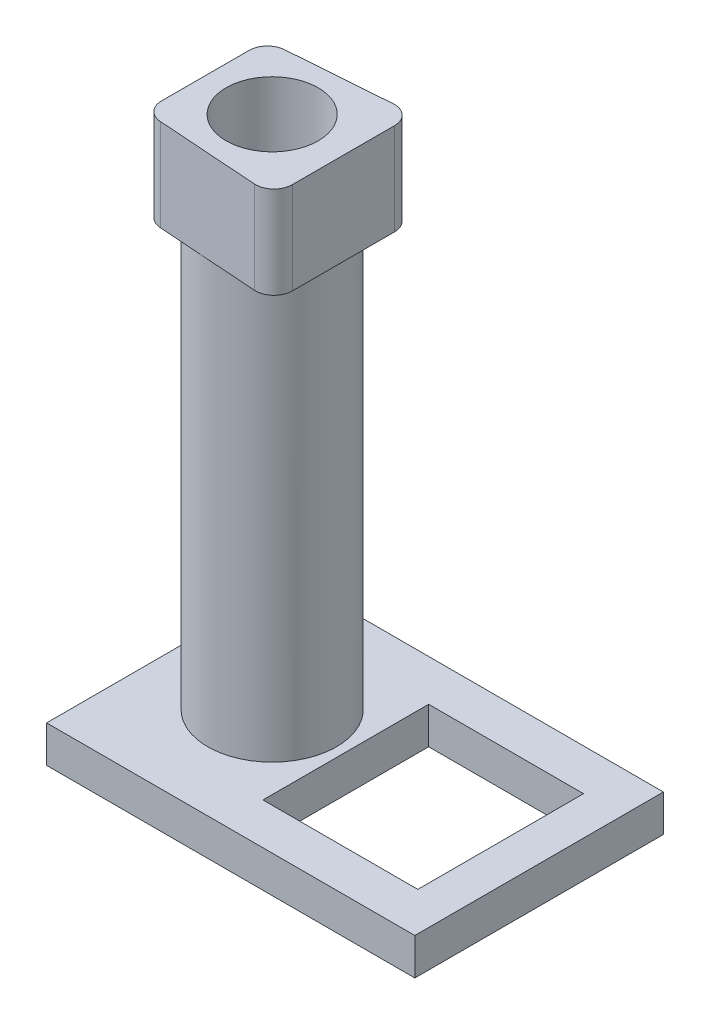
ISO-10303-21;
HEADER;
FILE_DESCRIPTION(('STEP AP214'),'2;1');
FILE_NAME('part.step','',(''),(''),'','','');
FILE_SCHEMA(('AUTOMOTIVE_DESIGN { 1 0 10303 214 1 1 1 1 }'));
ENDSEC;
DATA;
#1=APPLICATION_CONTEXT('core data for automotive mechanical design processes');
#2=APPLICATION_PROTOCOL_DEFINITION('international standard','automotive_design',2000,#1);
#3=PRODUCT_CONTEXT('',#1,'mechanical');
#4=PRODUCT('Part','Part','',(#3));
#5=PRODUCT_RELATED_PRODUCT_CATEGORY('part','',(#4));
#6=PRODUCT_DEFINITION_FORMATION('','',#4);
#7=PRODUCT_DEFINITION_CONTEXT('part definition',#1,'design');
#8=PRODUCT_DEFINITION('design','',#6,#7);
#9=PRODUCT_DEFINITION_SHAPE('','',#8);
#10=(LENGTH_UNIT() NAMED_UNIT(*) SI_UNIT(.MILLI.,.METRE.));
#11=(NAMED_UNIT(*) PLANE_ANGLE_UNIT() SI_UNIT($,.RADIAN.));
#12=(NAMED_UNIT(*) SI_UNIT($,.STERADIAN.) SOLID_ANGLE_UNIT());
#13=UNCERTAINTY_MEASURE_WITH_UNIT(LENGTH_MEASURE(1.E-05),#10,'distance_accuracy_value','');
#14=(GEOMETRIC_REPRESENTATION_CONTEXT(3) GLOBAL_UNCERTAINTY_ASSIGNED_CONTEXT((#13)) GLOBAL_UNIT_ASSIGNED_CONTEXT((#10,
#11,#12)) REPRESENTATION_CONTEXT('',''));
#15=CARTESIAN_POINT('',(0.,0.,0.));
#16=DIRECTION('',(0.,0.,1.));
#17=DIRECTION('',(1.,0.,0.));
#18=AXIS2_PLACEMENT_3D('',#15,#16,#17);
#19=CARTESIAN_POINT('',(0.,20.,0.));
#20=DIRECTION('',(0.,-1.,0.));
#21=DIRECTION('',(0.,0.,-1.));
#22=AXIS2_PLACEMENT_3D('',#19,#20,#21);
#23=PLANE('',#22);
#24=CARTESIAN_POINT('',(0.,20.,0.));
#25=DIRECTION('',(0.,-1.,0.));
#26=DIRECTION('',(0.,0.,-1.));
#27=AXIS2_PLACEMENT_3D('',#24,#25,#26);
#28=CIRCLE('',#27,35.);
#29=CARTESIAN_POINT('',(0.,20.,-35.));
#30=VERTEX_POINT('',#29);
#31=EDGE_CURVE('E12',#30,#30,#28,.F.);
#32=ORIENTED_EDGE('',*,*,#31,.F.);
#33=EDGE_LOOP('',(#32));
#34=FACE_BOUND('',#33,.T.);
#35=DIRECTION('',(0.,0.,-1.));
#36=VECTOR('',#35,1.);
#37=CARTESIAN_POINT('',(145.,20.,67.5));
#38=LINE('',#37,#36);
#39=CARTESIAN_POINT('',(145.,20.,67.5));
#40=VERTEX_POINT('',#39);
#41=CARTESIAN_POINT('',(145.,20.,-67.5));
#42=VERTEX_POINT('',#41);
#43=EDGE_CURVE('E218',#40,#42,#38,.T.);
#44=ORIENTED_EDGE('',*,*,#43,.T.);
#45=DIRECTION('',(-1.,0.,0.));
#46=VECTOR('',#45,1.);
#47=CARTESIAN_POINT('',(-55.,20.,-67.5));
#48=LINE('',#47,#46);
#49=CARTESIAN_POINT('',(-55.,20.,-67.5));
#50=VERTEX_POINT('',#49);
#51=EDGE_CURVE('E221',#42,#50,#48,.T.);
#52=ORIENTED_EDGE('',*,*,#51,.T.);
#53=DIRECTION('',(0.,0.,1.));
#54=VECTOR('',#53,1.);
#55=CARTESIAN_POINT('',(-55.,20.,67.5));
#56=LINE('',#55,#54);
#57=CARTESIAN_POINT('',(-55.,20.,67.5));
#58=VERTEX_POINT('',#57);
#59=EDGE_CURVE('E224',#50,#58,#56,.T.);
#60=ORIENTED_EDGE('',*,*,#59,.T.);
#61=DIRECTION('',(1.,0.,0.));
#62=VECTOR('',#61,1.);
#63=CARTESIAN_POINT('',(-55.,20.,67.5));
#64=LINE('',#63,#62);
#65=EDGE_CURVE('E226',#58,#40,#64,.T.);
#66=ORIENTED_EDGE('',*,*,#65,.T.);
#67=EDGE_LOOP('',(#44,#52,#60,#66));
#68=FACE_BOUND('',#67,.T.);
#69=DIRECTION('',(0.,0.,1.));
#70=VECTOR('',#69,1.);
#71=CARTESIAN_POINT('',(40.,20.,45.));
#72=LINE('',#71,#70);
#73=CARTESIAN_POINT('',(40.,20.,-45.));
#74=VERTEX_POINT('',#73);
#75=CARTESIAN_POINT('',(40.,20.,45.));
#76=VERTEX_POINT('',#75);
#77=EDGE_CURVE('E192',#74,#76,#72,.T.);
#78=ORIENTED_EDGE('',*,*,#77,.F.);
#79=DIRECTION('',(-1.,0.,0.));
#80=VECTOR('',#79,1.);
#81=CARTESIAN_POINT('',(40.,20.,-45.));
#82=LINE('',#81,#80);
#83=CARTESIAN_POINT('',(124.112104211628,20.,-45.));
#84=VERTEX_POINT('',#83);
#85=EDGE_CURVE('E199',#84,#74,#82,.T.);
#86=ORIENTED_EDGE('',*,*,#85,.F.);
#87=DIRECTION('',(0.,0.,-1.));
#88=VECTOR('',#87,1.);
#89=CARTESIAN_POINT('',(124.112104211628,20.,45.));
#90=LINE('',#89,#88);
#91=CARTESIAN_POINT('',(124.112104211628,20.,45.));
#92=VERTEX_POINT('',#91);
#93=EDGE_CURVE('E197',#92,#84,#90,.T.);
#94=ORIENTED_EDGE('',*,*,#93,.F.);
#95=DIRECTION('',(1.,0.,0.));
#96=VECTOR('',#95,1.);
#97=CARTESIAN_POINT('',(40.,20.,45.));
#98=LINE('',#97,#96);
#99=EDGE_CURVE('E194',#76,#92,#98,.T.);
#100=ORIENTED_EDGE('',*,*,#99,.F.);
#101=EDGE_LOOP('',(#78,#86,#94,#100));
#102=FACE_BOUND('',#101,.T.);
#103=ADVANCED_FACE('F40',(#34,#68,#102),#23,.F.);
#104=CARTESIAN_POINT('',(0.,0.,0.));
#105=DIRECTION('',(0.,-1.,0.));
#106=DIRECTION('',(0.,0.,-1.));
#107=AXIS2_PLACEMENT_3D('',#104,#105,#106);
#108=PLANE('',#107);
#109=DIRECTION('',(0.,0.,-1.));
#110=VECTOR('',#109,1.);
#111=CARTESIAN_POINT('',(145.,0.,67.5));
#112=LINE('',#111,#110);
#113=CARTESIAN_POINT('',(145.,0.,67.5));
#114=VERTEX_POINT('',#113);
#115=CARTESIAN_POINT('',(145.,0.,-67.5));
#116=VERTEX_POINT('',#115);
#117=EDGE_CURVE('E217',#114,#116,#112,.T.);
#118=ORIENTED_EDGE('',*,*,#117,.F.);
#119=DIRECTION('',(1.,0.,0.));
#120=VECTOR('',#119,1.);
#121=CARTESIAN_POINT('',(-55.,0.,67.5));
#122=LINE('',#121,#120);
#123=CARTESIAN_POINT('',(-55.,0.,67.5));
#124=VERTEX_POINT('',#123);
#125=EDGE_CURVE('E222',#124,#114,#122,.T.);
#126=ORIENTED_EDGE('',*,*,#125,.F.);
#127=DIRECTION('',(0.,0.,1.));
#128=VECTOR('',#127,1.);
#129=CARTESIAN_POINT('',(-55.,0.,67.5));
#130=LINE('',#129,#128);
#131=CARTESIAN_POINT('',(-55.,0.,-67.5));
#132=VERTEX_POINT('',#131);
#133=EDGE_CURVE('E233',#132,#124,#130,.T.);
#134=ORIENTED_EDGE('',*,*,#133,.F.);
#135=DIRECTION('',(-1.,0.,0.));
#136=VECTOR('',#135,1.);
#137=CARTESIAN_POINT('',(-55.,0.,-67.5));
#138=LINE('',#137,#136);
#139=EDGE_CURVE('E231',#116,#132,#138,.T.);
#140=ORIENTED_EDGE('',*,*,#139,.F.);
#141=EDGE_LOOP('',(#118,#126,#134,#140));
#142=FACE_BOUND('',#141,.T.);
#143=DIRECTION('',(-1.,0.,0.));
#144=VECTOR('',#143,1.);
#145=CARTESIAN_POINT('',(40.,0.,-45.));
#146=LINE('',#145,#144);
#147=CARTESIAN_POINT('',(124.112104211628,0.,-45.));
#148=VERTEX_POINT('',#147);
#149=CARTESIAN_POINT('',(40.,0.,-45.));
#150=VERTEX_POINT('',#149);
#151=EDGE_CURVE('E195',#148,#150,#146,.T.);
#152=ORIENTED_EDGE('',*,*,#151,.T.);
#153=DIRECTION('',(0.,0.,1.));
#154=VECTOR('',#153,1.);
#155=CARTESIAN_POINT('',(40.,0.,45.));
#156=LINE('',#155,#154);
#157=CARTESIAN_POINT('',(40.,0.,45.));
#158=VERTEX_POINT('',#157);
#159=EDGE_CURVE('E63',#150,#158,#156,.T.);
#160=ORIENTED_EDGE('',*,*,#159,.T.);
#161=DIRECTION('',(1.,0.,0.));
#162=VECTOR('',#161,1.);
#163=CARTESIAN_POINT('',(40.,0.,45.));
#164=LINE('',#163,#162);
#165=CARTESIAN_POINT('',(124.112104211628,0.,45.));
#166=VERTEX_POINT('',#165);
#167=EDGE_CURVE('E203',#158,#166,#164,.T.);
#168=ORIENTED_EDGE('',*,*,#167,.T.);
#169=DIRECTION('',(0.,0.,-1.));
#170=VECTOR('',#169,1.);
#171=CARTESIAN_POINT('',(124.112104211628,0.,45.));
#172=LINE('',#171,#170);
#173=EDGE_CURVE('E206',#166,#148,#172,.T.);
#174=ORIENTED_EDGE('',*,*,#173,.T.);
#175=EDGE_LOOP('',(#152,#160,#168,#174));
#176=FACE_BOUND('',#175,.T.);
#177=ADVANCED_FACE('F254',(#142,#176),#108,.T.);
#178=CARTESIAN_POINT('',(145.,20.,67.5));
#179=DIRECTION('',(-1.,0.,0.));
#180=DIRECTION('',(0.,0.,1.));
#181=AXIS2_PLACEMENT_3D('',#178,#179,#180);
#182=PLANE('',#181);
#183=ORIENTED_EDGE('',*,*,#117,.T.);
#184=DIRECTION('',(0.,-1.,0.));
#185=VECTOR('',#184,1.);
#186=CARTESIAN_POINT('',(145.,20.,-67.5));
#187=LINE('',#186,#185);
#188=EDGE_CURVE('E48',#42,#116,#187,.T.);
#189=ORIENTED_EDGE('',*,*,#188,.F.);
#190=ORIENTED_EDGE('',*,*,#43,.F.);
#191=DIRECTION('',(0.,-1.,0.));
#192=VECTOR('',#191,1.);
#193=CARTESIAN_POINT('',(145.,20.,67.5));
#194=LINE('',#193,#192);
#195=EDGE_CURVE('E228',#40,#114,#194,.T.);
#196=ORIENTED_EDGE('',*,*,#195,.T.);
#197=EDGE_LOOP('',(#183,#189,#190,#196));
#198=FACE_BOUND('',#197,.T.);
#199=ADVANCED_FACE('F42',(#198),#182,.F.);
#200=CARTESIAN_POINT('',(-55.,20.,-67.5));
#201=DIRECTION('',(0.,0.,1.));
#202=DIRECTION('',(1.,0.,0.));
#203=AXIS2_PLACEMENT_3D('',#200,#201,#202);
#204=PLANE('',#203);
#205=ORIENTED_EDGE('',*,*,#139,.T.);
#206=DIRECTION('',(0.,-1.,0.));
#207=VECTOR('',#206,1.);
#208=CARTESIAN_POINT('',(-55.,20.,-67.5));
#209=LINE('',#208,#207);
#210=EDGE_CURVE('E241',#50,#132,#209,.T.);
#211=ORIENTED_EDGE('',*,*,#210,.F.);
#212=ORIENTED_EDGE('',*,*,#51,.F.);
#213=ORIENTED_EDGE('',*,*,#188,.T.);
#214=EDGE_LOOP('',(#205,#211,#212,#213));
#215=FACE_BOUND('',#214,.T.);
#216=ADVANCED_FACE('F246',(#215),#204,.F.);
#217=CARTESIAN_POINT('',(-55.,20.,67.5));
#218=DIRECTION('',(1.,0.,0.));
#219=DIRECTION('',(0.,0.,-1.));
#220=AXIS2_PLACEMENT_3D('',#217,#218,#219);
#221=PLANE('',#220);
#222=ORIENTED_EDGE('',*,*,#133,.T.);
#223=DIRECTION('',(0.,-1.,0.));
#224=VECTOR('',#223,1.);
#225=CARTESIAN_POINT('',(-55.,20.,67.5));
#226=LINE('',#225,#224);
#227=EDGE_CURVE('E238',#58,#124,#226,.T.);
#228=ORIENTED_EDGE('',*,*,#227,.F.);
#229=ORIENTED_EDGE('',*,*,#59,.F.);
#230=ORIENTED_EDGE('',*,*,#210,.T.);
#231=EDGE_LOOP('',(#222,#228,#229,#230));
#232=FACE_BOUND('',#231,.T.);
#233=ADVANCED_FACE('F259',(#232),#221,.F.);
#234=CARTESIAN_POINT('',(-55.,20.,67.5));
#235=DIRECTION('',(0.,0.,-1.));
#236=DIRECTION('',(-1.,0.,0.));
#237=AXIS2_PLACEMENT_3D('',#234,#235,#236);
#238=PLANE('',#237);
#239=ORIENTED_EDGE('',*,*,#125,.T.);
#240=ORIENTED_EDGE('',*,*,#195,.F.);
#241=ORIENTED_EDGE('',*,*,#65,.F.);
#242=ORIENTED_EDGE('',*,*,#227,.T.);
#243=EDGE_LOOP('',(#239,#240,#241,#242));
#244=FACE_BOUND('',#243,.T.);
#245=ADVANCED_FACE('F263',(#244),#238,.F.);
#246=CARTESIAN_POINT('',(40.,20.,45.));
#247=DIRECTION('',(1.,0.,0.));
#248=DIRECTION('',(0.,0.,-1.));
#249=AXIS2_PLACEMENT_3D('',#246,#247,#248);
#250=PLANE('',#249);
#251=ORIENTED_EDGE('',*,*,#159,.F.);
#252=DIRECTION('',(0.,-1.,0.));
#253=VECTOR('',#252,1.);
#254=CARTESIAN_POINT('',(40.,20.,-45.));
#255=LINE('',#254,#253);
#256=EDGE_CURVE('E201',#74,#150,#255,.T.);
#257=ORIENTED_EDGE('',*,*,#256,.F.);
#258=ORIENTED_EDGE('',*,*,#77,.T.);
#259=DIRECTION('',(0.,-1.,0.));
#260=VECTOR('',#259,1.);
#261=CARTESIAN_POINT('',(40.,20.,45.));
#262=LINE('',#261,#260);
#263=EDGE_CURVE('E215',#76,#158,#262,.T.);
#264=ORIENTED_EDGE('',*,*,#263,.T.);
#265=EDGE_LOOP('',(#251,#257,#258,#264));
#266=FACE_BOUND('',#265,.T.);
#267=ADVANCED_FACE('F275',(#266),#250,.T.);
#268=CARTESIAN_POINT('',(40.,20.,45.));
#269=DIRECTION('',(0.,0.,-1.));
#270=DIRECTION('',(-1.,0.,0.));
#271=AXIS2_PLACEMENT_3D('',#268,#269,#270);
#272=PLANE('',#271);
#273=ORIENTED_EDGE('',*,*,#167,.F.);
#274=ORIENTED_EDGE('',*,*,#263,.F.);
#275=ORIENTED_EDGE('',*,*,#99,.T.);
#276=DIRECTION('',(0.,-1.,0.));
#277=VECTOR('',#276,1.);
#278=CARTESIAN_POINT('',(124.112104211628,20.,45.));
#279=LINE('',#278,#277);
#280=EDGE_CURVE('E213',#92,#166,#279,.T.);
#281=ORIENTED_EDGE('',*,*,#280,.T.);
#282=EDGE_LOOP('',(#273,#274,#275,#281));
#283=FACE_BOUND('',#282,.T.);
#284=ADVANCED_FACE('F277',(#283),#272,.T.);
#285=CARTESIAN_POINT('',(124.112104211628,20.,45.));
#286=DIRECTION('',(-1.,0.,0.));
#287=DIRECTION('',(0.,0.,1.));
#288=AXIS2_PLACEMENT_3D('',#285,#286,#287);
#289=PLANE('',#288);
#290=ORIENTED_EDGE('',*,*,#173,.F.);
#291=ORIENTED_EDGE('',*,*,#280,.F.);
#292=ORIENTED_EDGE('',*,*,#93,.T.);
#293=DIRECTION('',(0.,-1.,0.));
#294=VECTOR('',#293,1.);
#295=CARTESIAN_POINT('',(124.112104211628,20.,-45.));
#296=LINE('',#295,#294);
#297=EDGE_CURVE('E55',#84,#148,#296,.T.);
#298=ORIENTED_EDGE('',*,*,#297,.T.);
#299=EDGE_LOOP('',(#290,#291,#292,#298));
#300=FACE_BOUND('',#299,.T.);
#301=ADVANCED_FACE('F283',(#300),#289,.T.);
#302=CARTESIAN_POINT('',(40.,20.,-45.));
#303=DIRECTION('',(0.,0.,1.));
#304=DIRECTION('',(1.,0.,0.));
#305=AXIS2_PLACEMENT_3D('',#302,#303,#304);
#306=PLANE('',#305);
#307=ORIENTED_EDGE('',*,*,#151,.F.);
#308=ORIENTED_EDGE('',*,*,#297,.F.);
#309=ORIENTED_EDGE('',*,*,#85,.T.);
#310=ORIENTED_EDGE('',*,*,#256,.T.);
#311=EDGE_LOOP('',(#307,#308,#309,#310));
#312=FACE_BOUND('',#311,.T.);
#313=ADVANCED_FACE('F280',(#312),#306,.T.);
#314=CARTESIAN_POINT('',(0.,250.,0.));
#315=DIRECTION('',(0.,-1.,0.));
#316=DIRECTION('',(0.,0.,-1.));
#317=AXIS2_PLACEMENT_3D('',#314,#315,#316);
#318=CYLINDRICAL_SURFACE('',#317,35.);
#319=CARTESIAN_POINT('',(0.,250.,0.));
#320=DIRECTION('',(0.,1.,0.));
#321=DIRECTION('',(0.,0.,1.));
#322=AXIS2_PLACEMENT_3D('',#319,#320,#321);
#323=CIRCLE('',#322,35.);
#324=CARTESIAN_POINT('',(0.,250.,35.));
#325=VERTEX_POINT('',#324);
#326=EDGE_CURVE('E184',#325,#325,#323,.T.);
#327=ORIENTED_EDGE('',*,*,#326,.F.);
#328=EDGE_LOOP('',(#327));
#329=FACE_BOUND('',#328,.T.);
#330=ORIENTED_EDGE('',*,*,#31,.T.);
#331=EDGE_LOOP('',(#330));
#332=FACE_BOUND('',#331,.T.);
#333=ADVANCED_FACE('F282',(#329,#332),#318,.T.);
#334=CARTESIAN_POINT('',(-26.3285312441134,300.,23.7696796533461));
#335=DIRECTION('',(0.,1.,0.));
#336=DIRECTION('',(0.,0.,1.));
#337=AXIS2_PLACEMENT_3D('',#334,#335,#336);
#338=PLANE('',#337);
#339=CARTESIAN_POINT('',(-26.3285312441134,300.,23.7696796533461));
#340=DIRECTION('',(0.,1.,0.));
#341=DIRECTION('',(0.,0.,1.));
#342=AXIS2_PLACEMENT_3D('',#339,#340,#341);
#343=CIRCLE('',#342,10.);
#344=CARTESIAN_POINT('',(-36.3285312441134,300.,23.7696796533461));
#345=VERTEX_POINT('',#344);
#346=CARTESIAN_POINT('',(-27.0248886608192,300.,33.7454045066186));
#347=VERTEX_POINT('',#346);
#348=EDGE_CURVE('E166',#345,#347,#343,.T.);
#349=ORIENTED_EDGE('',*,*,#348,.T.);
#350=DIRECTION('',(0.997572485327251,0.,0.0696357416705782));
#351=VECTOR('',#350,1.);
#352=CARTESIAN_POINT('',(27.8706906796315,300.,37.5774011164232));
#353=LINE('',#352,#351);
#354=CARTESIAN_POINT('',(27.8706906796315,300.,37.5774011164232));
#355=VERTEX_POINT('',#354);
#356=EDGE_CURVE('E155',#347,#355,#353,.T.);
#357=ORIENTED_EDGE('',*,*,#356,.T.);
#358=CARTESIAN_POINT('',(28.5670480963372,300.,27.6016762631507));
#359=DIRECTION('',(0.,1.,0.));
#360=DIRECTION('',(0.,0.,-1.));
#361=AXIS2_PLACEMENT_3D('',#358,#359,#360);
#362=CIRCLE('',#361,10.);
#363=CARTESIAN_POINT('',(38.5670480963372,300.,27.6016762631506));
#364=VERTEX_POINT('',#363);
#365=EDGE_CURVE('E165',#355,#364,#362,.T.);
#366=ORIENTED_EDGE('',*,*,#365,.T.);
#367=DIRECTION('',(0.,0.,-1.));
#368=VECTOR('',#367,1.);
#369=CARTESIAN_POINT('',(38.5670480963372,300.,-27.8805403057291));
#370=LINE('',#369,#368);
#371=CARTESIAN_POINT('',(38.5670480963372,300.,-27.8805403057291));
#372=VERTEX_POINT('',#371);
#373=EDGE_CURVE('E455',#364,#372,#370,.T.);
#374=ORIENTED_EDGE('',*,*,#373,.T.);
#375=CARTESIAN_POINT('',(28.5670480963372,300.,-27.8805403057292));
#376=DIRECTION('',(0.,1.,0.));
#377=DIRECTION('',(0.,0.,-1.));
#378=AXIS2_PLACEMENT_3D('',#375,#376,#377);
#379=CIRCLE('',#378,10.);
#380=CARTESIAN_POINT('',(27.8223682808238,300.,-37.852774356952));
#381=VERTEX_POINT('',#380);
#382=EDGE_CURVE('E457',#372,#381,#379,.T.);
#383=ORIENTED_EDGE('',*,*,#382,.T.);
#384=DIRECTION('',(-0.997223405122277,0.,0.0744679815513468));
#385=VECTOR('',#384,1.);
#386=CARTESIAN_POINT('',(-27.0732110596268,300.,-33.7534291464633));
#387=LINE('',#386,#385);
#388=CARTESIAN_POINT('',(-27.0732110596268,300.,-33.7534291464633));
#389=VERTEX_POINT('',#388);
#390=EDGE_CURVE('E459',#381,#389,#387,.T.);
#391=ORIENTED_EDGE('',*,*,#390,.T.);
#392=CARTESIAN_POINT('',(-26.3285312441134,300.,-23.7811950952406));
#393=DIRECTION('',(0.,1.,0.));
#394=DIRECTION('',(0.,0.,-1.));
#395=AXIS2_PLACEMENT_3D('',#392,#393,#394);
#396=CIRCLE('',#395,10.);
#397=CARTESIAN_POINT('',(-36.3285312441134,300.,-23.7811950952405));
#398=VERTEX_POINT('',#397);
#399=EDGE_CURVE('E461',#389,#398,#396,.T.);
#400=ORIENTED_EDGE('',*,*,#399,.T.);
#401=DIRECTION('',(0.,0.,1.));
#402=VECTOR('',#401,1.);
#403=CARTESIAN_POINT('',(-36.3285312441134,300.,23.7696796533461));
#404=LINE('',#403,#402);
#405=EDGE_CURVE('E172',#398,#345,#404,.T.);
#406=ORIENTED_EDGE('',*,*,#405,.T.);
#407=EDGE_LOOP('',(#349,#357,#366,#374,#383,#391,#400,#406));
#408=FACE_BOUND('',#407,.T.);
#409=CARTESIAN_POINT('',(0.,300.,0.));
#410=DIRECTION('',(0.,1.,0.));
#411=DIRECTION('',(0.,0.,1.));
#412=AXIS2_PLACEMENT_3D('',#409,#410,#411);
#413=CIRCLE('',#412,25.);
#414=CARTESIAN_POINT('',(0.,300.,25.));
#415=VERTEX_POINT('',#414);
#416=EDGE_CURVE('E449',#415,#415,#413,.T.);
#417=ORIENTED_EDGE('',*,*,#416,.F.);
#418=EDGE_LOOP('',(#417));
#419=FACE_BOUND('',#418,.T.);
#420=ADVANCED_FACE('F169',(#408,#419),#338,.T.);
#421=CARTESIAN_POINT('',(-26.3285312441134,250.,23.7696796533461));
#422=DIRECTION('',(0.,1.,0.));
#423=DIRECTION('',(0.,0.,1.));
#424=AXIS2_PLACEMENT_3D('',#421,#422,#423);
#425=PLANE('',#424);
#426=ORIENTED_EDGE('',*,*,#326,.T.);
#427=EDGE_LOOP('',(#426));
#428=FACE_BOUND('',#427,.T.);
#429=CARTESIAN_POINT('',(-26.3285312441134,250.,23.7696796533461));
#430=DIRECTION('',(0.,1.,0.));
#431=DIRECTION('',(0.,0.,1.));
#432=AXIS2_PLACEMENT_3D('',#429,#430,#431);
#433=CIRCLE('',#432,10.);
#434=CARTESIAN_POINT('',(-36.3285312441134,250.,23.7696796533461));
#435=VERTEX_POINT('',#434);
#436=CARTESIAN_POINT('',(-27.0248886608192,250.,33.7454045066186));
#437=VERTEX_POINT('',#436);
#438=EDGE_CURVE('E180',#435,#437,#433,.T.);
#439=ORIENTED_EDGE('',*,*,#438,.F.);
#440=DIRECTION('',(0.,0.,1.));
#441=VECTOR('',#440,1.);
#442=CARTESIAN_POINT('',(-36.3285312441134,250.,23.7696796533461));
#443=LINE('',#442,#441);
#444=CARTESIAN_POINT('',(-36.3285312441134,250.,-23.7811950952405));
#445=VERTEX_POINT('',#444);
#446=EDGE_CURVE('E176',#445,#435,#443,.T.);
#447=ORIENTED_EDGE('',*,*,#446,.F.);
#448=CARTESIAN_POINT('',(-26.3285312441134,250.,-23.7811950952406));
#449=DIRECTION('',(0.,1.,0.));
#450=DIRECTION('',(0.,0.,-1.));
#451=AXIS2_PLACEMENT_3D('',#448,#449,#450);
#452=CIRCLE('',#451,10.);
#453=CARTESIAN_POINT('',(-27.0732110596268,250.,-33.7534291464633));
#454=VERTEX_POINT('',#453);
#455=EDGE_CURVE('E474',#454,#445,#452,.T.);
#456=ORIENTED_EDGE('',*,*,#455,.F.);
#457=DIRECTION('',(-0.997223405122277,0.,0.0744679815513468));
#458=VECTOR('',#457,1.);
#459=CARTESIAN_POINT('',(-27.0732110596268,250.,-33.7534291464633));
#460=LINE('',#459,#458);
#461=CARTESIAN_POINT('',(27.8223682808238,250.,-37.852774356952));
#462=VERTEX_POINT('',#461);
#463=EDGE_CURVE('E472',#462,#454,#460,.T.);
#464=ORIENTED_EDGE('',*,*,#463,.F.);
#465=CARTESIAN_POINT('',(28.5670480963372,250.,-27.8805403057292));
#466=DIRECTION('',(0.,1.,0.));
#467=DIRECTION('',(0.,0.,-1.));
#468=AXIS2_PLACEMENT_3D('',#465,#466,#467);
#469=CIRCLE('',#468,10.);
#470=CARTESIAN_POINT('',(38.5670480963372,250.,-27.8805403057291));
#471=VERTEX_POINT('',#470);
#472=EDGE_CURVE('E470',#471,#462,#469,.T.);
#473=ORIENTED_EDGE('',*,*,#472,.F.);
#474=DIRECTION('',(0.,0.,-1.));
#475=VECTOR('',#474,1.);
#476=CARTESIAN_POINT('',(38.5670480963372,250.,-27.8805403057291));
#477=LINE('',#476,#475);
#478=CARTESIAN_POINT('',(38.5670480963372,250.,27.6016762631506));
#479=VERTEX_POINT('',#478);
#480=EDGE_CURVE('E468',#479,#471,#477,.T.);
#481=ORIENTED_EDGE('',*,*,#480,.F.);
#482=CARTESIAN_POINT('',(28.5670480963372,250.,27.6016762631507));
#483=DIRECTION('',(0.,1.,0.));
#484=DIRECTION('',(0.,0.,-1.));
#485=AXIS2_PLACEMENT_3D('',#482,#483,#484);
#486=CIRCLE('',#485,10.);
#487=CARTESIAN_POINT('',(27.8706906796315,250.,37.5774011164232));
#488=VERTEX_POINT('',#487);
#489=EDGE_CURVE('E466',#488,#479,#486,.T.);
#490=ORIENTED_EDGE('',*,*,#489,.F.);
#491=DIRECTION('',(0.997572485327251,0.,0.0696357416705782));
#492=VECTOR('',#491,1.);
#493=CARTESIAN_POINT('',(27.8706906796315,250.,37.5774011164232));
#494=LINE('',#493,#492);
#495=EDGE_CURVE('E451',#437,#488,#494,.T.);
#496=ORIENTED_EDGE('',*,*,#495,.F.);
#497=EDGE_LOOP('',(#439,#447,#456,#464,#473,#481,#490,#496));
#498=FACE_BOUND('',#497,.T.);
#499=ADVANCED_FACE('F349',(#428,#498),#425,.F.);
#500=CARTESIAN_POINT('',(-26.3285312441134,300.,23.7696796533461));
#501=DIRECTION('',(0.,-1.,0.));
#502=DIRECTION('',(0.,0.,-1.));
#503=AXIS2_PLACEMENT_3D('',#500,#501,#502);
#504=CYLINDRICAL_SURFACE('',#503,10.);
#505=ORIENTED_EDGE('',*,*,#438,.T.);
#506=DIRECTION('',(0.,-1.,0.));
#507=VECTOR('',#506,1.);
#508=CARTESIAN_POINT('',(-27.0248886608192,300.,33.7454045066186));
#509=LINE('',#508,#507);
#510=EDGE_CURVE('E159',#347,#437,#509,.T.);
#511=ORIENTED_EDGE('',*,*,#510,.F.);
#512=ORIENTED_EDGE('',*,*,#348,.F.);
#513=DIRECTION('',(0.,-1.,0.));
#514=VECTOR('',#513,1.);
#515=CARTESIAN_POINT('',(-36.3285312441134,300.,23.7696796533461));
#516=LINE('',#515,#514);
#517=EDGE_CURVE('E463',#345,#435,#516,.T.);
#518=ORIENTED_EDGE('',*,*,#517,.T.);
#519=EDGE_LOOP('',(#505,#511,#512,#518));
#520=FACE_BOUND('',#519,.T.);
#521=ADVANCED_FACE('F178',(#520),#504,.T.);
#522=CARTESIAN_POINT('',(27.8706906796315,300.,37.5774011164232));
#523=DIRECTION('',(0.0696357416705782,0.,-0.997572485327251));
#524=DIRECTION('',(-0.997572485327251,0.,-0.0696357416705782));
#525=AXIS2_PLACEMENT_3D('',#522,#523,#524);
#526=PLANE('',#525);
#527=ORIENTED_EDGE('',*,*,#495,.T.);
#528=DIRECTION('',(0.,-1.,0.));
#529=VECTOR('',#528,1.);
#530=CARTESIAN_POINT('',(27.8706906796315,300.,37.5774011164232));
#531=LINE('',#530,#529);
#532=EDGE_CURVE('E162',#355,#488,#531,.T.);
#533=ORIENTED_EDGE('',*,*,#532,.F.);
#534=ORIENTED_EDGE('',*,*,#356,.F.);
#535=ORIENTED_EDGE('',*,*,#510,.T.);
#536=EDGE_LOOP('',(#527,#533,#534,#535));
#537=FACE_BOUND('',#536,.T.);
#538=ADVANCED_FACE('F157',(#537),#526,.F.);
#539=CARTESIAN_POINT('',(28.5670480963372,300.,27.6016762631507));
#540=DIRECTION('',(0.,-1.,0.));
#541=DIRECTION('',(0.,0.,-1.));
#542=AXIS2_PLACEMENT_3D('',#539,#540,#541);
#543=CYLINDRICAL_SURFACE('',#542,10.);
#544=ORIENTED_EDGE('',*,*,#489,.T.);
#545=DIRECTION('',(0.,-1.,0.));
#546=VECTOR('',#545,1.);
#547=CARTESIAN_POINT('',(38.5670480963372,300.,27.6016762631506));
#548=LINE('',#547,#546);
#549=EDGE_CURVE('E186',#364,#479,#548,.T.);
#550=ORIENTED_EDGE('',*,*,#549,.F.);
#551=ORIENTED_EDGE('',*,*,#365,.F.);
#552=ORIENTED_EDGE('',*,*,#532,.T.);
#553=EDGE_LOOP('',(#544,#550,#551,#552));
#554=FACE_BOUND('',#553,.T.);
#555=ADVANCED_FACE('F375',(#554),#543,.T.);
#556=CARTESIAN_POINT('',(38.5670480963372,300.,-27.8805403057291));
#557=DIRECTION('',(-1.,0.,0.));
#558=DIRECTION('',(0.,0.,1.));
#559=AXIS2_PLACEMENT_3D('',#556,#557,#558);
#560=PLANE('',#559);
#561=ORIENTED_EDGE('',*,*,#480,.T.);
#562=DIRECTION('',(0.,-1.,0.));
#563=VECTOR('',#562,1.);
#564=CARTESIAN_POINT('',(38.5670480963372,300.,-27.8805403057291));
#565=LINE('',#564,#563);
#566=EDGE_CURVE('E487',#372,#471,#565,.T.);
#567=ORIENTED_EDGE('',*,*,#566,.F.);
#568=ORIENTED_EDGE('',*,*,#373,.F.);
#569=ORIENTED_EDGE('',*,*,#549,.T.);
#570=EDGE_LOOP('',(#561,#567,#568,#569));
#571=FACE_BOUND('',#570,.T.);
#572=ADVANCED_FACE('F384',(#571),#560,.F.);
#573=CARTESIAN_POINT('',(28.5670480963372,300.,-27.8805403057292));
#574=DIRECTION('',(0.,-1.,0.));
#575=DIRECTION('',(0.,0.,-1.));
#576=AXIS2_PLACEMENT_3D('',#573,#574,#575);
#577=CYLINDRICAL_SURFACE('',#576,10.);
#578=ORIENTED_EDGE('',*,*,#472,.T.);
#579=DIRECTION('',(0.,-1.,0.));
#580=VECTOR('',#579,1.);
#581=CARTESIAN_POINT('',(27.8223682808238,300.,-37.852774356952));
#582=LINE('',#581,#580);
#583=EDGE_CURVE('E484',#381,#462,#582,.T.);
#584=ORIENTED_EDGE('',*,*,#583,.F.);
#585=ORIENTED_EDGE('',*,*,#382,.F.);
#586=ORIENTED_EDGE('',*,*,#566,.T.);
#587=EDGE_LOOP('',(#578,#584,#585,#586));
#588=FACE_BOUND('',#587,.T.);
#589=ADVANCED_FACE('F394',(#588),#577,.T.);
#590=CARTESIAN_POINT('',(-27.0732110596268,300.,-33.7534291464633));
#591=DIRECTION('',(0.0744679815513468,0.,0.997223405122277));
#592=DIRECTION('',(0.997223405122277,0.,-0.0744679815513468));
#593=AXIS2_PLACEMENT_3D('',#590,#591,#592);
#594=PLANE('',#593);
#595=ORIENTED_EDGE('',*,*,#463,.T.);
#596=DIRECTION('',(0.,-1.,0.));
#597=VECTOR('',#596,1.);
#598=CARTESIAN_POINT('',(-27.0732110596268,300.,-33.7534291464633));
#599=LINE('',#598,#597);
#600=EDGE_CURVE('E481',#389,#454,#599,.T.);
#601=ORIENTED_EDGE('',*,*,#600,.F.);
#602=ORIENTED_EDGE('',*,*,#390,.F.);
#603=ORIENTED_EDGE('',*,*,#583,.T.);
#604=EDGE_LOOP('',(#595,#601,#602,#603));
#605=FACE_BOUND('',#604,.T.);
#606=ADVANCED_FACE('F404',(#605),#594,.F.);
#607=CARTESIAN_POINT('',(-26.3285312441134,300.,-23.7811950952406));
#608=DIRECTION('',(0.,-1.,0.));
#609=DIRECTION('',(0.,0.,-1.));
#610=AXIS2_PLACEMENT_3D('',#607,#608,#609);
#611=CYLINDRICAL_SURFACE('',#610,10.);
#612=ORIENTED_EDGE('',*,*,#455,.T.);
#613=DIRECTION('',(0.,-1.,0.));
#614=VECTOR('',#613,1.);
#615=CARTESIAN_POINT('',(-36.3285312441134,300.,-23.7811950952405));
#616=LINE('',#615,#614);
#617=EDGE_CURVE('E478',#398,#445,#616,.T.);
#618=ORIENTED_EDGE('',*,*,#617,.F.);
#619=ORIENTED_EDGE('',*,*,#399,.F.);
#620=ORIENTED_EDGE('',*,*,#600,.T.);
#621=EDGE_LOOP('',(#612,#618,#619,#620));
#622=FACE_BOUND('',#621,.T.);
#623=ADVANCED_FACE('F414',(#622),#611,.T.);
#624=CARTESIAN_POINT('',(-36.3285312441134,300.,23.7696796533461));
#625=DIRECTION('',(1.,0.,0.));
#626=DIRECTION('',(0.,0.,-1.));
#627=AXIS2_PLACEMENT_3D('',#624,#625,#626);
#628=PLANE('',#627);
#629=ORIENTED_EDGE('',*,*,#446,.T.);
#630=ORIENTED_EDGE('',*,*,#517,.F.);
#631=ORIENTED_EDGE('',*,*,#405,.F.);
#632=ORIENTED_EDGE('',*,*,#617,.T.);
#633=EDGE_LOOP('',(#629,#630,#631,#632));
#634=FACE_BOUND('',#633,.T.);
#635=ADVANCED_FACE('F339',(#634),#628,.F.);
#636=CARTESIAN_POINT('',(0.,20.,0.));
#637=DIRECTION('',(0.,1.,0.));
#638=DIRECTION('',(1.,0.,0.));
#639=AXIS2_PLACEMENT_3D('',#636,#637,#638);
#640=CIRCLE('',#639,25.);
#641=CARTESIAN_POINT('',(25.,20.,0.));
#642=VERTEX_POINT('',#641);
#643=EDGE_CURVE('E181',#642,#642,#640,.T.);
#644=ORIENTED_EDGE('',*,*,#643,.T.);
#645=EDGE_LOOP('',(#644));
#646=FACE_BOUND('',#645,.T.);
#647=ADVANCED_FACE('F269',(#646),#23,.F.);
#648=CARTESIAN_POINT('',(0.,250.,0.));
#649=DIRECTION('',(0.,-1.,0.));
#650=DIRECTION('',(0.,0.,-1.));
#651=AXIS2_PLACEMENT_3D('',#648,#649,#650);
#652=CYLINDRICAL_SURFACE('',#651,25.);
#653=ORIENTED_EDGE('',*,*,#643,.F.);
#654=EDGE_LOOP('',(#653));
#655=FACE_BOUND('',#654,.T.);
#656=ORIENTED_EDGE('',*,*,#416,.T.);
#657=EDGE_LOOP('',(#656));
#658=FACE_BOUND('',#657,.T.);
#659=ADVANCED_FACE('F338',(#655,#658),#652,.F.);
#660=CLOSED_SHELL('',(#103,#177,#199,#216,#233,#245,#267,#284,#301,#313,#333,#420,#499,#521,
#538,#555,#572,#589,#606,#623,#635,#647,#659));
#661=MANIFOLD_SOLID_BREP('B2',#660);
#662=ADVANCED_BREP_SHAPE_REPRESENTATION('',(#18,#661),#14);
#663=SHAPE_DEFINITION_REPRESENTATION(#9,#662);
ENDSEC;
END-ISO-10303-21;
